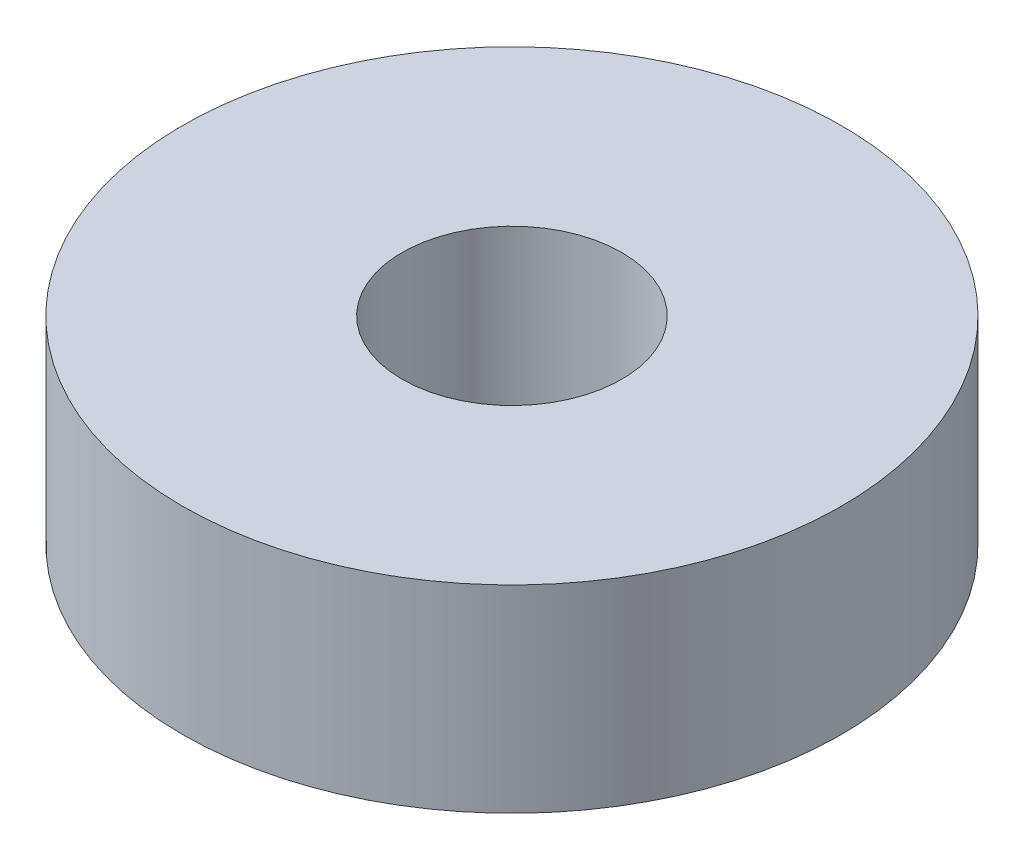
ISO-10303-21;
HEADER;
FILE_DESCRIPTION(('STEP AP214'),'2;1');
FILE_NAME('part.step','',(''),(''),'','','');
FILE_SCHEMA(('AUTOMOTIVE_DESIGN { 1 0 10303 214 1 1 1 1 }'));
ENDSEC;
DATA;
#1=APPLICATION_CONTEXT('core data for automotive mechanical design processes');
#2=APPLICATION_PROTOCOL_DEFINITION('international standard','automotive_design',2000,#1);
#3=PRODUCT_CONTEXT('',#1,'mechanical');
#4=PRODUCT('Part','Part','',(#3));
#5=PRODUCT_RELATED_PRODUCT_CATEGORY('part','',(#4));
#6=PRODUCT_DEFINITION_FORMATION('','',#4);
#7=PRODUCT_DEFINITION_CONTEXT('part definition',#1,'design');
#8=PRODUCT_DEFINITION('design','',#6,#7);
#9=PRODUCT_DEFINITION_SHAPE('','',#8);
#10=(LENGTH_UNIT() NAMED_UNIT(*) SI_UNIT(.MILLI.,.METRE.));
#11=(NAMED_UNIT(*) PLANE_ANGLE_UNIT() SI_UNIT($,.RADIAN.));
#12=(NAMED_UNIT(*) SI_UNIT($,.STERADIAN.) SOLID_ANGLE_UNIT());
#13=UNCERTAINTY_MEASURE_WITH_UNIT(LENGTH_MEASURE(1.E-05),#10,'distance_accuracy_value','');
#14=(GEOMETRIC_REPRESENTATION_CONTEXT(3) GLOBAL_UNCERTAINTY_ASSIGNED_CONTEXT((#13)) GLOBAL_UNIT_ASSIGNED_CONTEXT((#10,
#11,#12)) REPRESENTATION_CONTEXT('',''));
#15=CARTESIAN_POINT('',(0.,0.,0.));
#16=DIRECTION('',(0.,0.,1.));
#17=DIRECTION('',(1.,0.,0.));
#18=AXIS2_PLACEMENT_3D('',#15,#16,#17);
#19=CARTESIAN_POINT('',(0.,5.4,0.));
#20=DIRECTION('',(0.,1.,0.));
#21=DIRECTION('',(0.,0.,1.));
#22=AXIS2_PLACEMENT_3D('',#19,#20,#21);
#23=PLANE('',#22);
#24=CARTESIAN_POINT('',(0.,5.4,0.));
#25=DIRECTION('',(0.,1.,0.));
#26=DIRECTION('',(0.,0.,1.));
#27=AXIS2_PLACEMENT_3D('',#24,#25,#26);
#28=CIRCLE('',#27,9.);
#29=CARTESIAN_POINT('',(0.,5.4,9.));
#30=VERTEX_POINT('',#29);
#31=EDGE_CURVE('E10',#30,#30,#28,.T.);
#32=ORIENTED_EDGE('',*,*,#31,.T.);
#33=EDGE_LOOP('',(#32));
#34=FACE_BOUND('',#33,.T.);
#35=CARTESIAN_POINT('',(0.,5.4,0.));
#36=DIRECTION('',(0.,1.,0.));
#37=DIRECTION('',(0.,0.,1.));
#38=AXIS2_PLACEMENT_3D('',#35,#36,#37);
#39=CIRCLE('',#38,3.);
#40=CARTESIAN_POINT('',(0.,5.4,3.));
#41=VERTEX_POINT('',#40);
#42=EDGE_CURVE('E40',#41,#41,#39,.T.);
#43=ORIENTED_EDGE('',*,*,#42,.F.);
#44=EDGE_LOOP('',(#43));
#45=FACE_BOUND('',#44,.T.);
#46=ADVANCED_FACE('F29',(#34,#45),#23,.T.);
#47=CARTESIAN_POINT('',(0.,0.,0.));
#48=DIRECTION('',(0.,1.,0.));
#49=DIRECTION('',(0.,0.,1.));
#50=AXIS2_PLACEMENT_3D('',#47,#48,#49);
#51=PLANE('',#50);
#52=CARTESIAN_POINT('',(0.,0.,0.));
#53=DIRECTION('',(0.,1.,0.));
#54=DIRECTION('',(0.,0.,1.));
#55=AXIS2_PLACEMENT_3D('',#52,#53,#54);
#56=CIRCLE('',#55,9.);
#57=CARTESIAN_POINT('',(0.,0.,9.));
#58=VERTEX_POINT('',#57);
#59=EDGE_CURVE('E33',#58,#58,#56,.T.);
#60=ORIENTED_EDGE('',*,*,#59,.F.);
#61=EDGE_LOOP('',(#60));
#62=FACE_BOUND('',#61,.T.);
#63=CARTESIAN_POINT('',(0.,0.,0.));
#64=DIRECTION('',(0.,1.,0.));
#65=DIRECTION('',(0.,0.,1.));
#66=AXIS2_PLACEMENT_3D('',#63,#64,#65);
#67=CIRCLE('',#66,3.);
#68=CARTESIAN_POINT('',(0.,0.,3.));
#69=VERTEX_POINT('',#68);
#70=EDGE_CURVE('E42',#69,#69,#67,.T.);
#71=ORIENTED_EDGE('',*,*,#70,.T.);
#72=EDGE_LOOP('',(#71));
#73=FACE_BOUND('',#72,.T.);
#74=ADVANCED_FACE('F52',(#62,#73),#51,.F.);
#75=CARTESIAN_POINT('',(0.,5.4,0.));
#76=DIRECTION('',(0.,-1.,0.));
#77=DIRECTION('',(0.,0.,-1.));
#78=AXIS2_PLACEMENT_3D('',#75,#76,#77);
#79=CYLINDRICAL_SURFACE('',#78,9.);
#80=ORIENTED_EDGE('',*,*,#31,.F.);
#81=EDGE_LOOP('',(#80));
#82=FACE_BOUND('',#81,.T.);
#83=ORIENTED_EDGE('',*,*,#59,.T.);
#84=EDGE_LOOP('',(#83));
#85=FACE_BOUND('',#84,.T.);
#86=ADVANCED_FACE('F31',(#82,#85),#79,.T.);
#87=CARTESIAN_POINT('',(0.,5.4,0.));
#88=DIRECTION('',(0.,-1.,0.));
#89=DIRECTION('',(0.,0.,-1.));
#90=AXIS2_PLACEMENT_3D('',#87,#88,#89);
#91=CYLINDRICAL_SURFACE('',#90,3.);
#92=ORIENTED_EDGE('',*,*,#42,.T.);
#93=EDGE_LOOP('',(#92));
#94=FACE_BOUND('',#93,.T.);
#95=ORIENTED_EDGE('',*,*,#70,.F.);
#96=EDGE_LOOP('',(#95));
#97=FACE_BOUND('',#96,.T.);
#98=ADVANCED_FACE('F48',(#94,#97),#91,.F.);
#99=CLOSED_SHELL('',(#46,#74,#86,#98));
#100=MANIFOLD_SOLID_BREP('B2',#99);
#101=ADVANCED_BREP_SHAPE_REPRESENTATION('',(#18,#100),#14);
#102=SHAPE_DEFINITION_REPRESENTATION(#9,#101);
ENDSEC;
END-ISO-10303-21;
